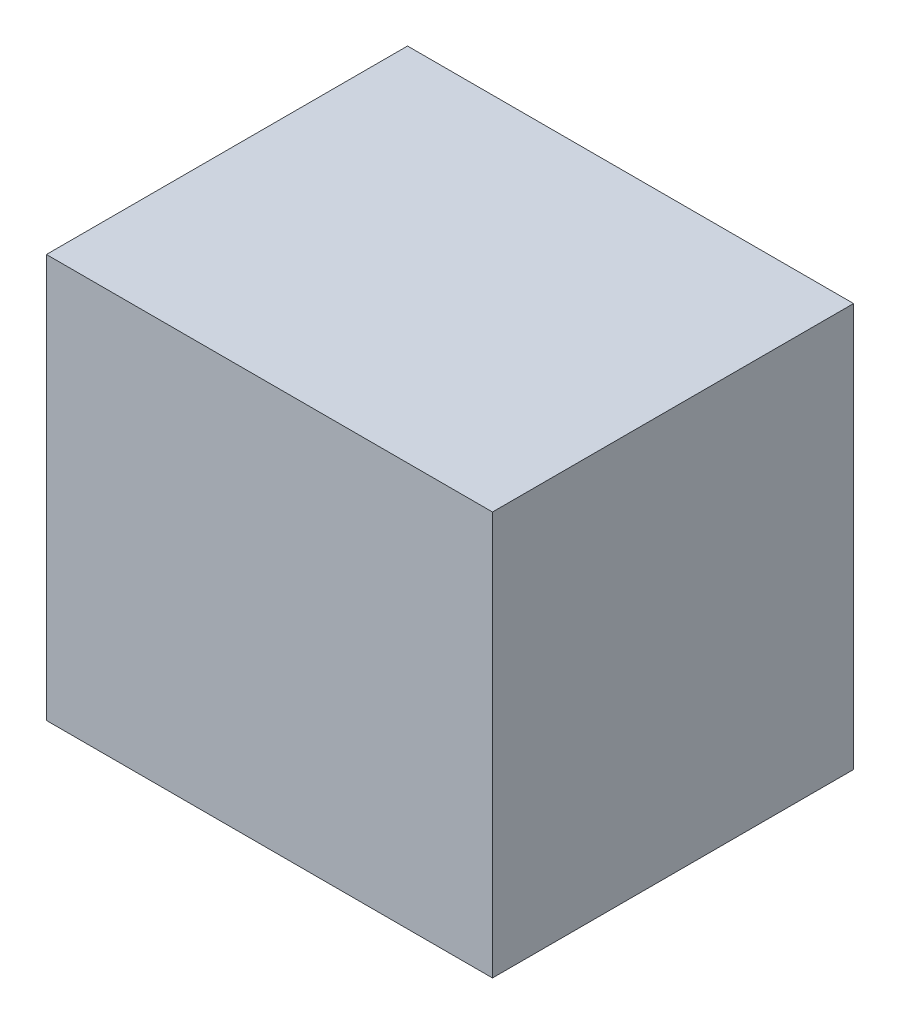
ISO-10303-21;
HEADER;
FILE_DESCRIPTION(('STEP AP214'),'2;1');
FILE_NAME('part.step','',(''),(''),'','','');
FILE_SCHEMA(('AUTOMOTIVE_DESIGN { 1 0 10303 214 1 1 1 1 }'));
ENDSEC;
DATA;
#1=APPLICATION_CONTEXT('core data for automotive mechanical design processes');
#2=APPLICATION_PROTOCOL_DEFINITION('international standard','automotive_design',2000,#1);
#3=PRODUCT_CONTEXT('',#1,'mechanical');
#4=PRODUCT('Part','Part','',(#3));
#5=PRODUCT_RELATED_PRODUCT_CATEGORY('part','',(#4));
#6=PRODUCT_DEFINITION_FORMATION('','',#4);
#7=PRODUCT_DEFINITION_CONTEXT('part definition',#1,'design');
#8=PRODUCT_DEFINITION('design','',#6,#7);
#9=PRODUCT_DEFINITION_SHAPE('','',#8);
#10=(LENGTH_UNIT() NAMED_UNIT(*) SI_UNIT(.MILLI.,.METRE.));
#11=(NAMED_UNIT(*) PLANE_ANGLE_UNIT() SI_UNIT($,.RADIAN.));
#12=(NAMED_UNIT(*) SI_UNIT($,.STERADIAN.) SOLID_ANGLE_UNIT());
#13=UNCERTAINTY_MEASURE_WITH_UNIT(LENGTH_MEASURE(1.E-05),#10,'distance_accuracy_value','');
#14=(GEOMETRIC_REPRESENTATION_CONTEXT(3) GLOBAL_UNCERTAINTY_ASSIGNED_CONTEXT((#13)) GLOBAL_UNIT_ASSIGNED_CONTEXT((#10,
#11,#12)) REPRESENTATION_CONTEXT('',''));
#15=CARTESIAN_POINT('',(0.,0.,0.));
#16=DIRECTION('',(0.,0.,1.));
#17=DIRECTION('',(1.,0.,0.));
#18=AXIS2_PLACEMENT_3D('',#15,#16,#17);
#19=CARTESIAN_POINT('',(0.52500022,-0.47499778,0.));
#20=DIRECTION('',(-1.,0.,0.));
#21=DIRECTION('',(0.,1.,0.));
#22=AXIS2_PLACEMENT_3D('',#19,#20,#21);
#23=PLANE('',#22);
#24=DIRECTION('',(0.,1.,0.));
#25=VECTOR('',#24,1.);
#26=CARTESIAN_POINT('',(0.52500022,-0.47499778,0.));
#27=LINE('',#26,#25);
#28=CARTESIAN_POINT('',(0.52500022,-0.47499778,0.));
#29=VERTEX_POINT('',#28);
#30=CARTESIAN_POINT('',(0.52500022,0.47500032,0.));
#31=VERTEX_POINT('',#30);
#32=EDGE_CURVE('E11',#29,#31,#27,.T.);
#33=ORIENTED_EDGE('',*,*,#32,.T.);
#34=DIRECTION('',(0.,0.,1.));
#35=VECTOR('',#34,1.);
#36=CARTESIAN_POINT('',(0.52500022,0.47500032,0.));
#37=LINE('',#36,#35);
#38=CARTESIAN_POINT('',(0.52500022,0.47500032,0.85000084));
#39=VERTEX_POINT('',#38);
#40=EDGE_CURVE('E24',#31,#39,#37,.T.);
#41=ORIENTED_EDGE('',*,*,#40,.T.);
#42=DIRECTION('',(0.,1.,0.));
#43=VECTOR('',#42,1.);
#44=CARTESIAN_POINT('',(0.52500022,-0.47499778,0.85000084));
#45=LINE('',#44,#43);
#46=CARTESIAN_POINT('',(0.52500022,-0.47499778,0.85000084));
#47=VERTEX_POINT('',#46);
#48=EDGE_CURVE('E87',#47,#39,#45,.T.);
#49=ORIENTED_EDGE('',*,*,#48,.F.);
#50=DIRECTION('',(0.,0.,1.));
#51=VECTOR('',#50,1.);
#52=CARTESIAN_POINT('',(0.52500022,-0.47499778,0.));
#53=LINE('',#52,#51);
#54=EDGE_CURVE('E36',#29,#47,#53,.T.);
#55=ORIENTED_EDGE('',*,*,#54,.F.);
#56=EDGE_LOOP('',(#33,#41,#49,#55));
#57=FACE_BOUND('',#56,.T.);
#58=ADVANCED_FACE('F17',(#57),#23,.F.);
#59=CARTESIAN_POINT('',(0.52500022,0.47500032,0.));
#60=DIRECTION('',(0.,-1.,0.));
#61=DIRECTION('',(-1.,0.,0.));
#62=AXIS2_PLACEMENT_3D('',#59,#60,#61);
#63=PLANE('',#62);
#64=DIRECTION('',(-1.,0.,0.));
#65=VECTOR('',#64,1.);
#66=CARTESIAN_POINT('',(0.52500022,0.47500032,0.));
#67=LINE('',#66,#65);
#68=CARTESIAN_POINT('',(-0.52500022,0.47500032,0.));
#69=VERTEX_POINT('',#68);
#70=EDGE_CURVE('E84',#31,#69,#67,.T.);
#71=ORIENTED_EDGE('',*,*,#70,.T.);
#72=DIRECTION('',(0.,0.,1.));
#73=VECTOR('',#72,1.);
#74=CARTESIAN_POINT('',(-0.52500022,0.47500032,0.));
#75=LINE('',#74,#73);
#76=CARTESIAN_POINT('',(-0.52500022,0.47500032,0.85000084));
#77=VERTEX_POINT('',#76);
#78=EDGE_CURVE('E82',#69,#77,#75,.T.);
#79=ORIENTED_EDGE('',*,*,#78,.T.);
#80=DIRECTION('',(-1.,0.,0.));
#81=VECTOR('',#80,1.);
#82=CARTESIAN_POINT('',(0.52500022,0.47500032,0.85000084));
#83=LINE('',#82,#81);
#84=EDGE_CURVE('E62',#39,#77,#83,.T.);
#85=ORIENTED_EDGE('',*,*,#84,.F.);
#86=ORIENTED_EDGE('',*,*,#40,.F.);
#87=EDGE_LOOP('',(#71,#79,#85,#86));
#88=FACE_BOUND('',#87,.T.);
#89=ADVANCED_FACE('F89',(#88),#63,.F.);
#90=CARTESIAN_POINT('',(-0.52500022,0.47500032,0.));
#91=DIRECTION('',(1.,0.,0.));
#92=DIRECTION('',(0.,-1.,0.));
#93=AXIS2_PLACEMENT_3D('',#90,#91,#92);
#94=PLANE('',#93);
#95=DIRECTION('',(0.,-1.,0.));
#96=VECTOR('',#95,1.);
#97=CARTESIAN_POINT('',(-0.52500022,0.47500032,0.));
#98=LINE('',#97,#96);
#99=CARTESIAN_POINT('',(-0.52500022,-0.47499778,0.));
#100=VERTEX_POINT('',#99);
#101=EDGE_CURVE('E71',#69,#100,#98,.T.);
#102=ORIENTED_EDGE('',*,*,#101,.T.);
#103=DIRECTION('',(0.,0.,1.));
#104=VECTOR('',#103,1.);
#105=CARTESIAN_POINT('',(-0.52500022,-0.47499778,0.));
#106=LINE('',#105,#104);
#107=CARTESIAN_POINT('',(-0.52500022,-0.47499778,0.85000084));
#108=VERTEX_POINT('',#107);
#109=EDGE_CURVE('E65',#100,#108,#106,.T.);
#110=ORIENTED_EDGE('',*,*,#109,.T.);
#111=DIRECTION('',(0.,-1.,0.));
#112=VECTOR('',#111,1.);
#113=CARTESIAN_POINT('',(-0.52500022,0.47500032,0.85000084));
#114=LINE('',#113,#112);
#115=EDGE_CURVE('E57',#77,#108,#114,.T.);
#116=ORIENTED_EDGE('',*,*,#115,.F.);
#117=ORIENTED_EDGE('',*,*,#78,.F.);
#118=EDGE_LOOP('',(#102,#110,#116,#117));
#119=FACE_BOUND('',#118,.T.);
#120=ADVANCED_FACE('F69',(#119),#94,.F.);
#121=CARTESIAN_POINT('',(-0.52500022,-0.47499778,0.));
#122=DIRECTION('',(0.,1.,0.));
#123=DIRECTION('',(1.,0.,0.));
#124=AXIS2_PLACEMENT_3D('',#121,#122,#123);
#125=PLANE('',#124);
#126=DIRECTION('',(1.,0.,0.));
#127=VECTOR('',#126,1.);
#128=CARTESIAN_POINT('',(-0.52500022,-0.47499778,0.));
#129=LINE('',#128,#127);
#130=EDGE_CURVE('E66',#100,#29,#129,.T.);
#131=ORIENTED_EDGE('',*,*,#130,.T.);
#132=ORIENTED_EDGE('',*,*,#54,.T.);
#133=DIRECTION('',(1.,0.,0.));
#134=VECTOR('',#133,1.);
#135=CARTESIAN_POINT('',(-0.52500022,-0.47499778,0.85000084));
#136=LINE('',#135,#134);
#137=EDGE_CURVE('E61',#108,#47,#136,.T.);
#138=ORIENTED_EDGE('',*,*,#137,.F.);
#139=ORIENTED_EDGE('',*,*,#109,.F.);
#140=EDGE_LOOP('',(#131,#132,#138,#139));
#141=FACE_BOUND('',#140,.T.);
#142=ADVANCED_FACE('F76',(#141),#125,.F.);
#143=CARTESIAN_POINT('',(0.52500022,-0.47499778,0.));
#144=DIRECTION('',(0.,0.,-1.));
#145=DIRECTION('',(-1.,0.,0.));
#146=AXIS2_PLACEMENT_3D('',#143,#144,#145);
#147=PLANE('',#146);
#148=ORIENTED_EDGE('',*,*,#130,.F.);
#149=ORIENTED_EDGE('',*,*,#101,.F.);
#150=ORIENTED_EDGE('',*,*,#70,.F.);
#151=ORIENTED_EDGE('',*,*,#32,.F.);
#152=EDGE_LOOP('',(#148,#149,#150,#151));
#153=FACE_BOUND('',#152,.T.);
#154=ADVANCED_FACE('F91',(#153),#147,.T.);
#155=CARTESIAN_POINT('',(0.52500022,-0.47499778,0.85000084));
#156=DIRECTION('',(0.,0.,-1.));
#157=DIRECTION('',(-1.,0.,0.));
#158=AXIS2_PLACEMENT_3D('',#155,#156,#157);
#159=PLANE('',#158);
#160=ORIENTED_EDGE('',*,*,#48,.T.);
#161=ORIENTED_EDGE('',*,*,#84,.T.);
#162=ORIENTED_EDGE('',*,*,#115,.T.);
#163=ORIENTED_EDGE('',*,*,#137,.T.);
#164=EDGE_LOOP('',(#160,#161,#162,#163));
#165=FACE_BOUND('',#164,.T.);
#166=ADVANCED_FACE('F59',(#165),#159,.F.);
#167=CLOSED_SHELL('',(#58,#89,#120,#142,#154,#166));
#168=MANIFOLD_SOLID_BREP('B1',#167);
#169=ADVANCED_BREP_SHAPE_REPRESENTATION('',(#18,#168),#14);
#170=SHAPE_DEFINITION_REPRESENTATION(#9,#169);
ENDSEC;
END-ISO-10303-21;
